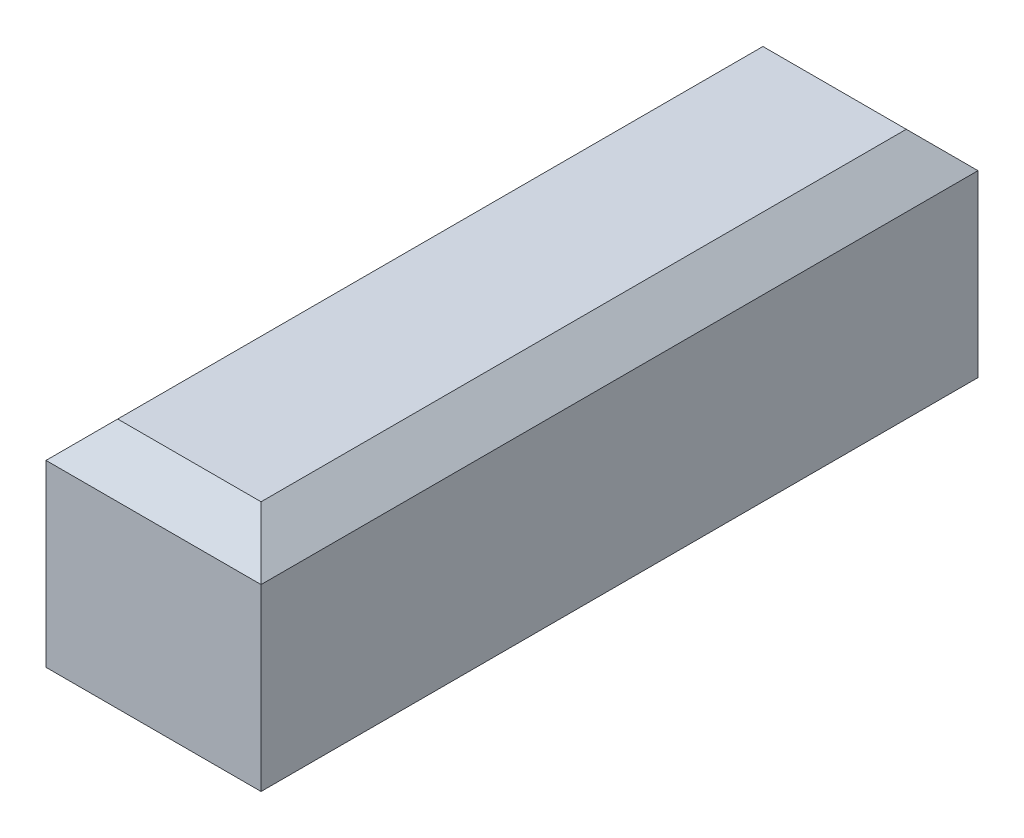
ISO-10303-21;
HEADER;
FILE_DESCRIPTION(('STEP AP214'),'2;1');
FILE_NAME('part.step','',(''),(''),'','','');
FILE_SCHEMA(('AUTOMOTIVE_DESIGN { 1 0 10303 214 1 1 1 1 }'));
ENDSEC;
DATA;
#1=APPLICATION_CONTEXT('core data for automotive mechanical design processes');
#2=APPLICATION_PROTOCOL_DEFINITION('international standard','automotive_design',2000,#1);
#3=PRODUCT_CONTEXT('',#1,'mechanical');
#4=PRODUCT('Part','Part','',(#3));
#5=PRODUCT_RELATED_PRODUCT_CATEGORY('part','',(#4));
#6=PRODUCT_DEFINITION_FORMATION('','',#4);
#7=PRODUCT_DEFINITION_CONTEXT('part definition',#1,'design');
#8=PRODUCT_DEFINITION('design','',#6,#7);
#9=PRODUCT_DEFINITION_SHAPE('','',#8);
#10=(LENGTH_UNIT() NAMED_UNIT(*) SI_UNIT(.MILLI.,.METRE.));
#11=(NAMED_UNIT(*) PLANE_ANGLE_UNIT() SI_UNIT($,.RADIAN.));
#12=(NAMED_UNIT(*) SI_UNIT($,.STERADIAN.) SOLID_ANGLE_UNIT());
#13=UNCERTAINTY_MEASURE_WITH_UNIT(LENGTH_MEASURE(1.E-05),#10,'distance_accuracy_value','');
#14=(GEOMETRIC_REPRESENTATION_CONTEXT(3) GLOBAL_UNCERTAINTY_ASSIGNED_CONTEXT((#13)) GLOBAL_UNIT_ASSIGNED_CONTEXT((#10,
#11,#12)) REPRESENTATION_CONTEXT('',''));
#15=CARTESIAN_POINT('',(0.,0.,0.));
#16=DIRECTION('',(0.,0.,1.));
#17=DIRECTION('',(1.,0.,0.));
#18=AXIS2_PLACEMENT_3D('',#15,#16,#17);
#19=CARTESIAN_POINT('',(0.,18.,0.));
#20=DIRECTION('',(-1.,0.,0.));
#21=DIRECTION('',(0.,0.,1.));
#22=AXIS2_PLACEMENT_3D('',#19,#20,#21);
#23=PLANE('',#22);
#24=DIRECTION('',(0.,-1.,0.));
#25=VECTOR('',#24,1.);
#26=CARTESIAN_POINT('',(0.,18.,-59.9999999999999));
#27=LINE('',#26,#25);
#28=CARTESIAN_POINT('',(0.,15.,-59.9999999999999));
#29=VERTEX_POINT('',#28);
#30=CARTESIAN_POINT('',(0.,0.,-59.9999999999999));
#31=VERTEX_POINT('',#30);
#32=EDGE_CURVE('E89',#29,#31,#27,.T.);
#33=ORIENTED_EDGE('',*,*,#32,.F.);
#34=DIRECTION('',(0.,0.,1.));
#35=VECTOR('',#34,1.);
#36=CARTESIAN_POINT('',(0.,15.,0.));
#37=LINE('',#36,#35);
#38=CARTESIAN_POINT('',(0.,15.,0.));
#39=VERTEX_POINT('',#38);
#40=EDGE_CURVE('E59',#29,#39,#37,.T.);
#41=ORIENTED_EDGE('',*,*,#40,.T.);
#42=DIRECTION('',(0.,-1.,0.));
#43=VECTOR('',#42,1.);
#44=CARTESIAN_POINT('',(0.,18.,0.));
#45=LINE('',#44,#43);
#46=CARTESIAN_POINT('',(0.,0.,0.));
#47=VERTEX_POINT('',#46);
#48=EDGE_CURVE('E109',#39,#47,#45,.T.);
#49=ORIENTED_EDGE('',*,*,#48,.T.);
#50=DIRECTION('',(0.,0.,-1.));
#51=VECTOR('',#50,1.);
#52=CARTESIAN_POINT('',(0.,0.,0.));
#53=LINE('',#52,#51);
#54=EDGE_CURVE('E105',#47,#31,#53,.T.);
#55=ORIENTED_EDGE('',*,*,#54,.T.);
#56=EDGE_LOOP('',(#33,#41,#49,#55));
#57=FACE_BOUND('',#56,.T.);
#58=ADVANCED_FACE('F35',(#57),#23,.F.);
#59=CARTESIAN_POINT('',(0.,18.,-59.9999999999999));
#60=DIRECTION('',(0.,0.,1.));
#61=DIRECTION('',(1.,0.,0.));
#62=AXIS2_PLACEMENT_3D('',#59,#60,#61);
#63=PLANE('',#62);
#64=DIRECTION('',(0.,-1.,0.));
#65=VECTOR('',#64,1.);
#66=CARTESIAN_POINT('',(-18.,18.,-59.9999999999999));
#67=LINE('',#66,#65);
#68=CARTESIAN_POINT('',(-18.,15.,-59.9999999999999));
#69=VERTEX_POINT('',#68);
#70=CARTESIAN_POINT('',(-18.,0.,-59.9999999999999));
#71=VERTEX_POINT('',#70);
#72=EDGE_CURVE('E99',#69,#71,#67,.T.);
#73=ORIENTED_EDGE('',*,*,#72,.F.);
#74=DIRECTION('',(1.,0.,0.));
#75=VECTOR('',#74,1.);
#76=CARTESIAN_POINT('',(0.,15.,-59.9999999999999));
#77=LINE('',#76,#75);
#78=EDGE_CURVE('E96',#69,#29,#77,.T.);
#79=ORIENTED_EDGE('',*,*,#78,.T.);
#80=ORIENTED_EDGE('',*,*,#32,.T.);
#81=DIRECTION('',(-1.,0.,0.));
#82=VECTOR('',#81,1.);
#83=CARTESIAN_POINT('',(0.,0.,-59.9999999999999));
#84=LINE('',#83,#82);
#85=EDGE_CURVE('E93',#31,#71,#84,.T.);
#86=ORIENTED_EDGE('',*,*,#85,.T.);
#87=EDGE_LOOP('',(#73,#79,#80,#86));
#88=FACE_BOUND('',#87,.T.);
#89=ADVANCED_FACE('F92',(#88),#63,.F.);
#90=CARTESIAN_POINT('',(-18.,18.,0.));
#91=DIRECTION('',(1.,0.,0.));
#92=DIRECTION('',(0.,0.,-1.));
#93=AXIS2_PLACEMENT_3D('',#90,#91,#92);
#94=PLANE('',#93);
#95=DIRECTION('',(0.,-1.,0.));
#96=VECTOR('',#95,1.);
#97=CARTESIAN_POINT('',(-18.,18.,0.));
#98=LINE('',#97,#96);
#99=CARTESIAN_POINT('',(-18.,15.,0.));
#100=VERTEX_POINT('',#99);
#101=CARTESIAN_POINT('',(-18.,0.,0.));
#102=VERTEX_POINT('',#101);
#103=EDGE_CURVE('E119',#100,#102,#98,.T.);
#104=ORIENTED_EDGE('',*,*,#103,.F.);
#105=DIRECTION('',(0.,0.,-1.));
#106=VECTOR('',#105,1.);
#107=CARTESIAN_POINT('',(-18.,15.,-59.9999999999999));
#108=LINE('',#107,#106);
#109=EDGE_CURVE('E11',#100,#69,#108,.T.);
#110=ORIENTED_EDGE('',*,*,#109,.T.);
#111=ORIENTED_EDGE('',*,*,#72,.T.);
#112=DIRECTION('',(0.,0.,1.));
#113=VECTOR('',#112,1.);
#114=CARTESIAN_POINT('',(-18.,0.,0.));
#115=LINE('',#114,#113);
#116=EDGE_CURVE('E107',#71,#102,#115,.T.);
#117=ORIENTED_EDGE('',*,*,#116,.T.);
#118=EDGE_LOOP('',(#104,#110,#111,#117));
#119=FACE_BOUND('',#118,.T.);
#120=ADVANCED_FACE('F166',(#119),#94,.F.);
#121=CARTESIAN_POINT('',(0.,18.,0.));
#122=DIRECTION('',(0.,0.,-1.));
#123=DIRECTION('',(-1.,0.,0.));
#124=AXIS2_PLACEMENT_3D('',#121,#122,#123);
#125=PLANE('',#124);
#126=ORIENTED_EDGE('',*,*,#48,.F.);
#127=DIRECTION('',(-1.,0.,0.));
#128=VECTOR('',#127,1.);
#129=CARTESIAN_POINT('',(-18.,15.,0.));
#130=LINE('',#129,#128);
#131=EDGE_CURVE('E44',#39,#100,#130,.T.);
#132=ORIENTED_EDGE('',*,*,#131,.T.);
#133=ORIENTED_EDGE('',*,*,#103,.T.);
#134=DIRECTION('',(1.,0.,0.));
#135=VECTOR('',#134,1.);
#136=CARTESIAN_POINT('',(0.,0.,0.));
#137=LINE('',#136,#135);
#138=EDGE_CURVE('E116',#102,#47,#137,.T.);
#139=ORIENTED_EDGE('',*,*,#138,.T.);
#140=EDGE_LOOP('',(#126,#132,#133,#139));
#141=FACE_BOUND('',#140,.T.);
#142=ADVANCED_FACE('F198',(#141),#125,.F.);
#143=CARTESIAN_POINT('',(0.,18.,0.));
#144=DIRECTION('',(0.,1.,0.));
#145=DIRECTION('',(0.,0.,1.));
#146=AXIS2_PLACEMENT_3D('',#143,#144,#145);
#147=PLANE('',#146);
#148=DIRECTION('',(0.,0.,-1.));
#149=VECTOR('',#148,1.);
#150=CARTESIAN_POINT('',(-2.99999999999999,18.,-59.9999999999999));
#151=LINE('',#150,#149);
#152=CARTESIAN_POINT('',(-2.99999999999999,18.,-2.99999999999999));
#153=VERTEX_POINT('',#152);
#154=CARTESIAN_POINT('',(-2.99999999999999,18.,-57.));
#155=VERTEX_POINT('',#154);
#156=EDGE_CURVE('E125',#153,#155,#151,.T.);
#157=ORIENTED_EDGE('',*,*,#156,.T.);
#158=DIRECTION('',(-1.,0.,0.));
#159=VECTOR('',#158,1.);
#160=CARTESIAN_POINT('',(-18.,18.,-57.));
#161=LINE('',#160,#159);
#162=CARTESIAN_POINT('',(-15.,18.,-57.));
#163=VERTEX_POINT('',#162);
#164=EDGE_CURVE('E127',#155,#163,#161,.T.);
#165=ORIENTED_EDGE('',*,*,#164,.T.);
#166=DIRECTION('',(0.,0.,1.));
#167=VECTOR('',#166,1.);
#168=CARTESIAN_POINT('',(-15.,18.,0.));
#169=LINE('',#168,#167);
#170=CARTESIAN_POINT('',(-15.,18.,-2.99999999999999));
#171=VERTEX_POINT('',#170);
#172=EDGE_CURVE('E98',#163,#171,#169,.T.);
#173=ORIENTED_EDGE('',*,*,#172,.T.);
#174=DIRECTION('',(1.,0.,0.));
#175=VECTOR('',#174,1.);
#176=CARTESIAN_POINT('',(0.,18.,-2.99999999999999));
#177=LINE('',#176,#175);
#178=EDGE_CURVE('E123',#171,#153,#177,.T.);
#179=ORIENTED_EDGE('',*,*,#178,.T.);
#180=EDGE_LOOP('',(#157,#165,#173,#179));
#181=FACE_BOUND('',#180,.T.);
#182=ADVANCED_FACE('F148',(#181),#147,.T.);
#183=CARTESIAN_POINT('',(0.,0.,0.));
#184=DIRECTION('',(0.,1.,0.));
#185=DIRECTION('',(0.,0.,1.));
#186=AXIS2_PLACEMENT_3D('',#183,#184,#185);
#187=PLANE('',#186);
#188=ORIENTED_EDGE('',*,*,#54,.F.);
#189=ORIENTED_EDGE('',*,*,#138,.F.);
#190=ORIENTED_EDGE('',*,*,#116,.F.);
#191=ORIENTED_EDGE('',*,*,#85,.F.);
#192=EDGE_LOOP('',(#188,#189,#190,#191));
#193=FACE_BOUND('',#192,.T.);
#194=ADVANCED_FACE('F103',(#193),#187,.F.);
#195=CARTESIAN_POINT('',(0.,18.,-2.99999999999999));
#196=DIRECTION('',(0.,0.707106781186546,0.707106781186549));
#197=DIRECTION('',(-1.,0.,0.));
#198=AXIS2_PLACEMENT_3D('',#195,#196,#197);
#199=PLANE('',#198);
#200=DIRECTION('',(0.577350269189625,0.577350269189628,-0.577350269189625));
#201=VECTOR('',#200,1.);
#202=CARTESIAN_POINT('',(-16.,17.,-2.));
#203=LINE('',#202,#201);
#204=EDGE_CURVE('E113',#100,#171,#203,.T.);
#205=ORIENTED_EDGE('',*,*,#204,.F.);
#206=ORIENTED_EDGE('',*,*,#131,.F.);
#207=DIRECTION('',(-0.577350269189625,0.577350269189628,-0.577350269189625));
#208=VECTOR('',#207,1.);
#209=CARTESIAN_POINT('',(-2.,17.,-2.));
#210=LINE('',#209,#208);
#211=EDGE_CURVE('E39',#153,#39,#210,.F.);
#212=ORIENTED_EDGE('',*,*,#211,.F.);
#213=ORIENTED_EDGE('',*,*,#178,.F.);
#214=EDGE_LOOP('',(#205,#206,#212,#213));
#215=FACE_BOUND('',#214,.T.);
#216=ADVANCED_FACE('F37',(#215),#199,.T.);
#217=CARTESIAN_POINT('',(-2.99999999999999,18.,0.));
#218=DIRECTION('',(0.707106781186549,0.707106781186546,0.));
#219=DIRECTION('',(0.,0.,1.));
#220=AXIS2_PLACEMENT_3D('',#217,#218,#219);
#221=PLANE('',#220);
#222=ORIENTED_EDGE('',*,*,#211,.T.);
#223=ORIENTED_EDGE('',*,*,#40,.F.);
#224=DIRECTION('',(-0.577350269189625,0.577350269189628,0.577350269189625));
#225=VECTOR('',#224,1.);
#226=CARTESIAN_POINT('',(-21.9999999999999,37.,-38.));
#227=LINE('',#226,#225);
#228=EDGE_CURVE('E135',#155,#29,#227,.F.);
#229=ORIENTED_EDGE('',*,*,#228,.F.);
#230=ORIENTED_EDGE('',*,*,#156,.F.);
#231=EDGE_LOOP('',(#222,#223,#229,#230));
#232=FACE_BOUND('',#231,.T.);
#233=ADVANCED_FACE('F154',(#232),#221,.T.);
#234=CARTESIAN_POINT('',(-15.,18.,0.));
#235=DIRECTION('',(-0.707106781186549,0.707106781186546,0.));
#236=DIRECTION('',(0.,0.,-1.));
#237=AXIS2_PLACEMENT_3D('',#234,#235,#236);
#238=PLANE('',#237);
#239=ORIENTED_EDGE('',*,*,#204,.T.);
#240=ORIENTED_EDGE('',*,*,#172,.F.);
#241=DIRECTION('',(-0.577350269189625,-0.577350269189628,-0.577350269189625));
#242=VECTOR('',#241,1.);
#243=CARTESIAN_POINT('',(3.99999999999991,37.,-38.));
#244=LINE('',#243,#242);
#245=EDGE_CURVE('E133',#69,#163,#244,.F.);
#246=ORIENTED_EDGE('',*,*,#245,.F.);
#247=ORIENTED_EDGE('',*,*,#109,.F.);
#248=EDGE_LOOP('',(#239,#240,#246,#247));
#249=FACE_BOUND('',#248,.T.);
#250=ADVANCED_FACE('F141',(#249),#238,.T.);
#251=CARTESIAN_POINT('',(0.,18.,-57.));
#252=DIRECTION('',(0.,0.707106781186546,-0.707106781186549));
#253=DIRECTION('',(1.,0.,0.));
#254=AXIS2_PLACEMENT_3D('',#251,#252,#253);
#255=PLANE('',#254);
#256=ORIENTED_EDGE('',*,*,#228,.T.);
#257=ORIENTED_EDGE('',*,*,#78,.F.);
#258=ORIENTED_EDGE('',*,*,#245,.T.);
#259=ORIENTED_EDGE('',*,*,#164,.F.);
#260=EDGE_LOOP('',(#256,#257,#258,#259));
#261=FACE_BOUND('',#260,.T.);
#262=ADVANCED_FACE('F152',(#261),#255,.T.);
#263=CLOSED_SHELL('',(#58,#89,#120,#142,#182,#194,#216,#233,#250,#262));
#264=MANIFOLD_SOLID_BREP('B2',#263);
#265=ADVANCED_BREP_SHAPE_REPRESENTATION('',(#18,#264),#14);
#266=SHAPE_DEFINITION_REPRESENTATION(#9,#265);
ENDSEC;
END-ISO-10303-21;
